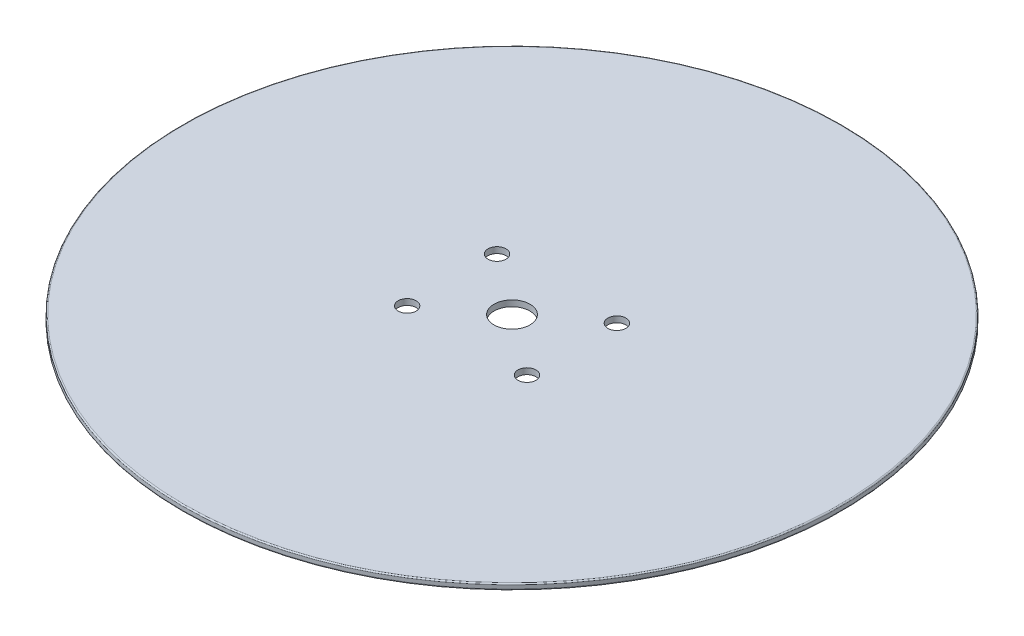
ISO-10303-21;
HEADER;
FILE_DESCRIPTION(('STEP AP214'),'2;1');
FILE_NAME('part.step','',(''),(''),'','','');
FILE_SCHEMA(('AUTOMOTIVE_DESIGN { 1 0 10303 214 1 1 1 1 }'));
ENDSEC;
DATA;
#1=APPLICATION_CONTEXT('core data for automotive mechanical design processes');
#2=APPLICATION_PROTOCOL_DEFINITION('international standard','automotive_design',2000,#1);
#3=PRODUCT_CONTEXT('',#1,'mechanical');
#4=PRODUCT('Part','Part','',(#3));
#5=PRODUCT_RELATED_PRODUCT_CATEGORY('part','',(#4));
#6=PRODUCT_DEFINITION_FORMATION('','',#4);
#7=PRODUCT_DEFINITION_CONTEXT('part definition',#1,'design');
#8=PRODUCT_DEFINITION('design','',#6,#7);
#9=PRODUCT_DEFINITION_SHAPE('','',#8);
#10=(LENGTH_UNIT() NAMED_UNIT(*) SI_UNIT(.MILLI.,.METRE.));
#11=(NAMED_UNIT(*) PLANE_ANGLE_UNIT() SI_UNIT($,.RADIAN.));
#12=(NAMED_UNIT(*) SI_UNIT($,.STERADIAN.) SOLID_ANGLE_UNIT());
#13=UNCERTAINTY_MEASURE_WITH_UNIT(LENGTH_MEASURE(1.E-05),#10,'distance_accuracy_value','');
#14=(GEOMETRIC_REPRESENTATION_CONTEXT(3) GLOBAL_UNCERTAINTY_ASSIGNED_CONTEXT((#13)) GLOBAL_UNIT_ASSIGNED_CONTEXT((#10,
#11,#12)) REPRESENTATION_CONTEXT('',''));
#15=CARTESIAN_POINT('',(0.,0.,0.));
#16=DIRECTION('',(0.,0.,1.));
#17=DIRECTION('',(1.,0.,0.));
#18=AXIS2_PLACEMENT_3D('',#15,#16,#17);
#19=CARTESIAN_POINT('',(0.,1.,0.));
#20=DIRECTION('',(0.,-1.,0.));
#21=DIRECTION('',(0.,0.,-1.));
#22=AXIS2_PLACEMENT_3D('',#19,#20,#21);
#23=CYLINDRICAL_SURFACE('',#22,55.);
#24=CARTESIAN_POINT('',(0.,0.8,0.));
#25=DIRECTION('',(0.,1.,0.));
#26=DIRECTION('',(0.,0.,1.));
#27=AXIS2_PLACEMENT_3D('',#24,#25,#26);
#28=CIRCLE('',#27,55.);
#29=CARTESIAN_POINT('',(0.,0.8,55.));
#30=VERTEX_POINT('',#29);
#31=EDGE_CURVE('E40',#30,#30,#28,.F.);
#32=ORIENTED_EDGE('',*,*,#31,.T.);
#33=EDGE_LOOP('',(#32));
#34=FACE_BOUND('',#33,.T.);
#35=CARTESIAN_POINT('',(0.,0.2,0.));
#36=DIRECTION('',(0.,1.,0.));
#37=DIRECTION('',(0.,0.,1.));
#38=AXIS2_PLACEMENT_3D('',#35,#36,#37);
#39=CIRCLE('',#38,55.);
#40=CARTESIAN_POINT('',(0.,0.2,55.));
#41=VERTEX_POINT('',#40);
#42=EDGE_CURVE('E44',#41,#41,#39,.T.);
#43=ORIENTED_EDGE('',*,*,#42,.T.);
#44=EDGE_LOOP('',(#43));
#45=FACE_BOUND('',#44,.T.);
#46=ADVANCED_FACE('F33',(#34,#45),#23,.T.);
#47=CARTESIAN_POINT('',(0.,1.,0.));
#48=DIRECTION('',(0.,1.,0.));
#49=DIRECTION('',(0.,0.,1.));
#50=AXIS2_PLACEMENT_3D('',#47,#48,#49);
#51=PLANE('',#50);
#52=CARTESIAN_POINT('',(-10.,1.,7.5));
#53=DIRECTION('',(0.,1.,0.));
#54=DIRECTION('',(0.,0.,1.));
#55=AXIS2_PLACEMENT_3D('',#52,#53,#54);
#56=CIRCLE('',#55,1.5);
#57=CARTESIAN_POINT('',(-10.,1.,9.));
#58=VERTEX_POINT('',#57);
#59=EDGE_CURVE('E78',#58,#58,#56,.T.);
#60=ORIENTED_EDGE('',*,*,#59,.F.);
#61=EDGE_LOOP('',(#60));
#62=FACE_BOUND('',#61,.T.);
#63=CARTESIAN_POINT('',(10.,1.,7.5));
#64=DIRECTION('',(0.,1.,0.));
#65=DIRECTION('',(0.,0.,1.));
#66=AXIS2_PLACEMENT_3D('',#63,#64,#65);
#67=CIRCLE('',#66,1.5);
#68=CARTESIAN_POINT('',(10.,1.,9.));
#69=VERTEX_POINT('',#68);
#70=EDGE_CURVE('E72',#69,#69,#67,.T.);
#71=ORIENTED_EDGE('',*,*,#70,.F.);
#72=EDGE_LOOP('',(#71));
#73=FACE_BOUND('',#72,.T.);
#74=CARTESIAN_POINT('',(10.,1.,-7.5));
#75=DIRECTION('',(0.,1.,0.));
#76=DIRECTION('',(0.,0.,1.));
#77=AXIS2_PLACEMENT_3D('',#74,#75,#76);
#78=CIRCLE('',#77,1.5);
#79=CARTESIAN_POINT('',(10.,1.,-6.));
#80=VERTEX_POINT('',#79);
#81=EDGE_CURVE('E66',#80,#80,#78,.T.);
#82=ORIENTED_EDGE('',*,*,#81,.F.);
#83=EDGE_LOOP('',(#82));
#84=FACE_BOUND('',#83,.T.);
#85=CARTESIAN_POINT('',(-10.,1.,-7.5));
#86=DIRECTION('',(0.,1.,0.));
#87=DIRECTION('',(0.,0.,1.));
#88=AXIS2_PLACEMENT_3D('',#85,#86,#87);
#89=CIRCLE('',#88,1.5);
#90=CARTESIAN_POINT('',(-10.,1.,-6.));
#91=VERTEX_POINT('',#90);
#92=EDGE_CURVE('E60',#91,#91,#89,.T.);
#93=ORIENTED_EDGE('',*,*,#92,.F.);
#94=EDGE_LOOP('',(#93));
#95=FACE_BOUND('',#94,.T.);
#96=CARTESIAN_POINT('',(0.,1.,0.));
#97=DIRECTION('',(0.,1.,0.));
#98=DIRECTION('',(0.,0.,1.));
#99=AXIS2_PLACEMENT_3D('',#96,#97,#98);
#100=CIRCLE('',#99,3.);
#101=CARTESIAN_POINT('',(0.,1.,3.));
#102=VERTEX_POINT('',#101);
#103=EDGE_CURVE('E54',#102,#102,#100,.T.);
#104=ORIENTED_EDGE('',*,*,#103,.F.);
#105=EDGE_LOOP('',(#104));
#106=FACE_BOUND('',#105,.T.);
#107=CARTESIAN_POINT('',(0.,1.,0.));
#108=DIRECTION('',(0.,1.,0.));
#109=DIRECTION('',(0.,0.,1.));
#110=AXIS2_PLACEMENT_3D('',#107,#108,#109);
#111=CIRCLE('',#110,54.8);
#112=CARTESIAN_POINT('',(0.,1.,54.8));
#113=VERTEX_POINT('',#112);
#114=EDGE_CURVE('E48',#113,#113,#111,.T.);
#115=ORIENTED_EDGE('',*,*,#114,.T.);
#116=EDGE_LOOP('',(#115));
#117=FACE_BOUND('',#116,.T.);
#118=ADVANCED_FACE('F94',(#62,#73,#84,#95,#106,#117),#51,.T.);
#119=CARTESIAN_POINT('',(0.,0.,0.));
#120=DIRECTION('',(0.,1.,0.));
#121=DIRECTION('',(0.,0.,1.));
#122=AXIS2_PLACEMENT_3D('',#119,#120,#121);
#123=PLANE('',#122);
#124=CARTESIAN_POINT('',(-10.,0.,7.5));
#125=DIRECTION('',(0.,1.,0.));
#126=DIRECTION('',(0.,0.,1.));
#127=AXIS2_PLACEMENT_3D('',#124,#125,#126);
#128=CIRCLE('',#127,1.5);
#129=CARTESIAN_POINT('',(-10.,0.,9.));
#130=VERTEX_POINT('',#129);
#131=EDGE_CURVE('E75',#130,#130,#128,.T.);
#132=ORIENTED_EDGE('',*,*,#131,.T.);
#133=EDGE_LOOP('',(#132));
#134=FACE_BOUND('',#133,.T.);
#135=CARTESIAN_POINT('',(10.,0.,7.5));
#136=DIRECTION('',(0.,1.,0.));
#137=DIRECTION('',(0.,0.,1.));
#138=AXIS2_PLACEMENT_3D('',#135,#136,#137);
#139=CIRCLE('',#138,1.5);
#140=CARTESIAN_POINT('',(10.,0.,9.));
#141=VERTEX_POINT('',#140);
#142=EDGE_CURVE('E69',#141,#141,#139,.T.);
#143=ORIENTED_EDGE('',*,*,#142,.T.);
#144=EDGE_LOOP('',(#143));
#145=FACE_BOUND('',#144,.T.);
#146=CARTESIAN_POINT('',(10.,0.,-7.5));
#147=DIRECTION('',(0.,1.,0.));
#148=DIRECTION('',(0.,0.,1.));
#149=AXIS2_PLACEMENT_3D('',#146,#147,#148);
#150=CIRCLE('',#149,1.5);
#151=CARTESIAN_POINT('',(10.,0.,-6.));
#152=VERTEX_POINT('',#151);
#153=EDGE_CURVE('E63',#152,#152,#150,.T.);
#154=ORIENTED_EDGE('',*,*,#153,.T.);
#155=EDGE_LOOP('',(#154));
#156=FACE_BOUND('',#155,.T.);
#157=CARTESIAN_POINT('',(-10.,0.,-7.5));
#158=DIRECTION('',(0.,1.,0.));
#159=DIRECTION('',(0.,0.,1.));
#160=AXIS2_PLACEMENT_3D('',#157,#158,#159);
#161=CIRCLE('',#160,1.5);
#162=CARTESIAN_POINT('',(-10.,0.,-6.));
#163=VERTEX_POINT('',#162);
#164=EDGE_CURVE('E57',#163,#163,#161,.T.);
#165=ORIENTED_EDGE('',*,*,#164,.T.);
#166=EDGE_LOOP('',(#165));
#167=FACE_BOUND('',#166,.T.);
#168=CARTESIAN_POINT('',(0.,0.,0.));
#169=DIRECTION('',(0.,1.,0.));
#170=DIRECTION('',(0.,0.,1.));
#171=AXIS2_PLACEMENT_3D('',#168,#169,#170);
#172=CIRCLE('',#171,3.);
#173=CARTESIAN_POINT('',(0.,0.,3.));
#174=VERTEX_POINT('',#173);
#175=EDGE_CURVE('E53',#174,#174,#172,.T.);
#176=ORIENTED_EDGE('',*,*,#175,.T.);
#177=EDGE_LOOP('',(#176));
#178=FACE_BOUND('',#177,.T.);
#179=CARTESIAN_POINT('',(0.,0.,0.));
#180=DIRECTION('',(0.,1.,0.));
#181=DIRECTION('',(0.,0.,1.));
#182=AXIS2_PLACEMENT_3D('',#179,#180,#181);
#183=CIRCLE('',#182,54.8);
#184=CARTESIAN_POINT('',(0.,0.,54.8));
#185=VERTEX_POINT('',#184);
#186=EDGE_CURVE('E10',#185,#185,#183,.F.);
#187=ORIENTED_EDGE('',*,*,#186,.T.);
#188=EDGE_LOOP('',(#187));
#189=FACE_BOUND('',#188,.T.);
#190=ADVANCED_FACE('F84',(#134,#145,#156,#167,#178,#189),#123,.F.);
#191=CARTESIAN_POINT('',(0.,0.8,0.));
#192=DIRECTION('',(0.,1.,0.));
#193=DIRECTION('',(0.,0.,1.));
#194=AXIS2_PLACEMENT_3D('',#191,#192,#193);
#195=TOROIDAL_SURFACE('',#194,54.8,0.2);
#196=ORIENTED_EDGE('',*,*,#31,.F.);
#197=EDGE_LOOP('',(#196));
#198=FACE_BOUND('',#197,.T.);
#199=ORIENTED_EDGE('',*,*,#114,.F.);
#200=EDGE_LOOP('',(#199));
#201=FACE_BOUND('',#200,.T.);
#202=ADVANCED_FACE('F108',(#198,#201),#195,.T.);
#203=CARTESIAN_POINT('',(0.,0.2,0.));
#204=DIRECTION('',(0.,1.,0.));
#205=DIRECTION('',(0.,0.,1.));
#206=AXIS2_PLACEMENT_3D('',#203,#204,#205);
#207=TOROIDAL_SURFACE('',#206,54.8,0.2);
#208=ORIENTED_EDGE('',*,*,#186,.F.);
#209=EDGE_LOOP('',(#208));
#210=FACE_BOUND('',#209,.T.);
#211=ORIENTED_EDGE('',*,*,#42,.F.);
#212=EDGE_LOOP('',(#211));
#213=FACE_BOUND('',#212,.T.);
#214=ADVANCED_FACE('F35',(#210,#213),#207,.T.);
#215=CARTESIAN_POINT('',(0.,0.,0.));
#216=DIRECTION('',(0.,1.,0.));
#217=DIRECTION('',(0.,0.,1.));
#218=AXIS2_PLACEMENT_3D('',#215,#216,#217);
#219=CYLINDRICAL_SURFACE('',#218,3.);
#220=ORIENTED_EDGE('',*,*,#175,.F.);
#221=EDGE_LOOP('',(#220));
#222=FACE_BOUND('',#221,.T.);
#223=ORIENTED_EDGE('',*,*,#103,.T.);
#224=EDGE_LOOP('',(#223));
#225=FACE_BOUND('',#224,.T.);
#226=ADVANCED_FACE('F115',(#222,#225),#219,.F.);
#227=CARTESIAN_POINT('',(-10.,0.,-7.5));
#228=DIRECTION('',(0.,1.,0.));
#229=DIRECTION('',(0.,0.,1.));
#230=AXIS2_PLACEMENT_3D('',#227,#228,#229);
#231=CYLINDRICAL_SURFACE('',#230,1.5);
#232=ORIENTED_EDGE('',*,*,#164,.F.);
#233=EDGE_LOOP('',(#232));
#234=FACE_BOUND('',#233,.T.);
#235=ORIENTED_EDGE('',*,*,#92,.T.);
#236=EDGE_LOOP('',(#235));
#237=FACE_BOUND('',#236,.T.);
#238=ADVANCED_FACE('F126',(#234,#237),#231,.F.);
#239=CARTESIAN_POINT('',(10.,0.,-7.5));
#240=DIRECTION('',(0.,1.,0.));
#241=DIRECTION('',(0.,0.,1.));
#242=AXIS2_PLACEMENT_3D('',#239,#240,#241);
#243=CYLINDRICAL_SURFACE('',#242,1.5);
#244=ORIENTED_EDGE('',*,*,#153,.F.);
#245=EDGE_LOOP('',(#244));
#246=FACE_BOUND('',#245,.T.);
#247=ORIENTED_EDGE('',*,*,#81,.T.);
#248=EDGE_LOOP('',(#247));
#249=FACE_BOUND('',#248,.T.);
#250=ADVANCED_FACE('F130',(#246,#249),#243,.F.);
#251=CARTESIAN_POINT('',(10.,0.,7.5));
#252=DIRECTION('',(0.,1.,0.));
#253=DIRECTION('',(0.,0.,1.));
#254=AXIS2_PLACEMENT_3D('',#251,#252,#253);
#255=CYLINDRICAL_SURFACE('',#254,1.5);
#256=ORIENTED_EDGE('',*,*,#142,.F.);
#257=EDGE_LOOP('',(#256));
#258=FACE_BOUND('',#257,.T.);
#259=ORIENTED_EDGE('',*,*,#70,.T.);
#260=EDGE_LOOP('',(#259));
#261=FACE_BOUND('',#260,.T.);
#262=ADVANCED_FACE('F90',(#258,#261),#255,.F.);
#263=CARTESIAN_POINT('',(-10.,0.,7.5));
#264=DIRECTION('',(0.,1.,0.));
#265=DIRECTION('',(0.,0.,1.));
#266=AXIS2_PLACEMENT_3D('',#263,#264,#265);
#267=CYLINDRICAL_SURFACE('',#266,1.5);
#268=ORIENTED_EDGE('',*,*,#131,.F.);
#269=EDGE_LOOP('',(#268));
#270=FACE_BOUND('',#269,.T.);
#271=ORIENTED_EDGE('',*,*,#59,.T.);
#272=EDGE_LOOP('',(#271));
#273=FACE_BOUND('',#272,.T.);
#274=ADVANCED_FACE('F87',(#270,#273),#267,.F.);
#275=CLOSED_SHELL('',(#46,#118,#190,#202,#214,#226,#238,#250,#262,#274));
#276=MANIFOLD_SOLID_BREP('B2',#275);
#277=ADVANCED_BREP_SHAPE_REPRESENTATION('',(#18,#276),#14);
#278=SHAPE_DEFINITION_REPRESENTATION(#9,#277);
ENDSEC;
END-ISO-10303-21;
